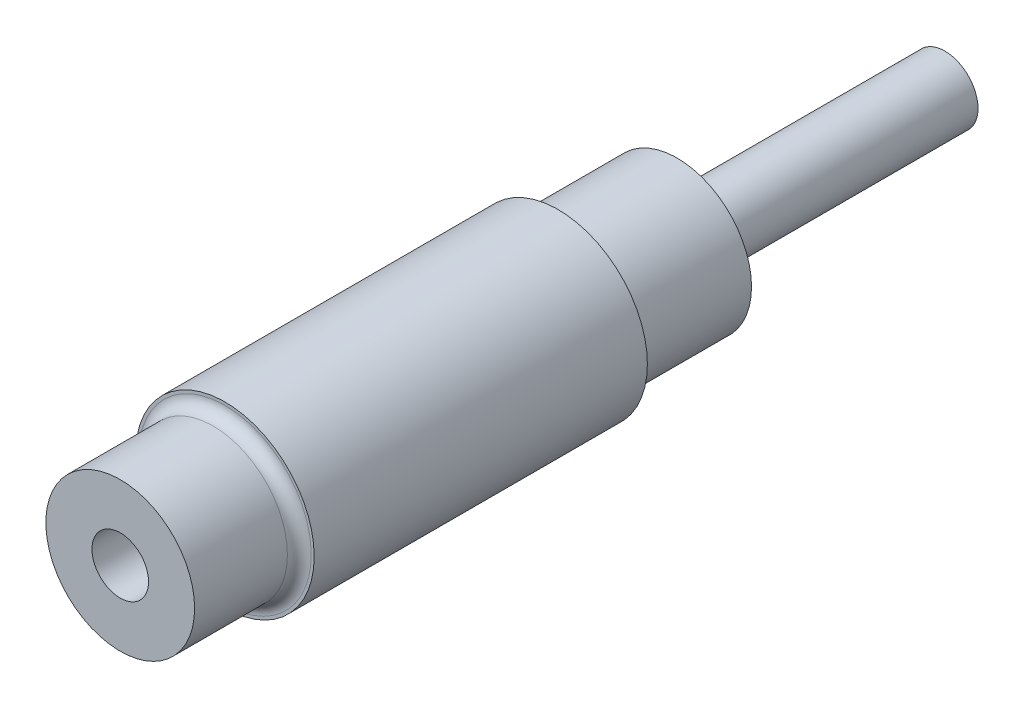
ISO-10303-21;
HEADER;
FILE_DESCRIPTION(('STEP AP214'),'2;1');
FILE_NAME('part.step','',(''),(''),'','','');
FILE_SCHEMA(('AUTOMOTIVE_DESIGN { 1 0 10303 214 1 1 1 1 }'));
ENDSEC;
DATA;
#1=APPLICATION_CONTEXT('core data for automotive mechanical design processes');
#2=APPLICATION_PROTOCOL_DEFINITION('international standard','automotive_design',2000,#1);
#3=PRODUCT_CONTEXT('',#1,'mechanical');
#4=PRODUCT('Part','Part','',(#3));
#5=PRODUCT_RELATED_PRODUCT_CATEGORY('part','',(#4));
#6=PRODUCT_DEFINITION_FORMATION('','',#4);
#7=PRODUCT_DEFINITION_CONTEXT('part definition',#1,'design');
#8=PRODUCT_DEFINITION('design','',#6,#7);
#9=PRODUCT_DEFINITION_SHAPE('','',#8);
#10=(LENGTH_UNIT() NAMED_UNIT(*) SI_UNIT(.MILLI.,.METRE.));
#11=(NAMED_UNIT(*) PLANE_ANGLE_UNIT() SI_UNIT($,.RADIAN.));
#12=(NAMED_UNIT(*) SI_UNIT($,.STERADIAN.) SOLID_ANGLE_UNIT());
#13=UNCERTAINTY_MEASURE_WITH_UNIT(LENGTH_MEASURE(1.E-05),#10,'distance_accuracy_value','');
#14=(GEOMETRIC_REPRESENTATION_CONTEXT(3) GLOBAL_UNCERTAINTY_ASSIGNED_CONTEXT((#13)) GLOBAL_UNIT_ASSIGNED_CONTEXT((#10,
#11,#12)) REPRESENTATION_CONTEXT('',''));
#15=CARTESIAN_POINT('',(0.,0.,0.));
#16=DIRECTION('',(0.,0.,1.));
#17=DIRECTION('',(1.,0.,0.));
#18=AXIS2_PLACEMENT_3D('',#15,#16,#17);
#19=CARTESIAN_POINT('',(0.,0.,93.6));
#20=DIRECTION('',(0.,0.,-1.));
#21=DIRECTION('',(-1.,0.,0.));
#22=AXIS2_PLACEMENT_3D('',#19,#20,#21);
#23=CYLINDRICAL_SURFACE('',#22,12.5);
#24=CARTESIAN_POINT('',(0.,0.,18.5));
#25=DIRECTION('',(0.,0.,1.));
#26=DIRECTION('',(1.,0.,0.));
#27=AXIS2_PLACEMENT_3D('',#24,#25,#26);
#28=CIRCLE('',#27,12.5);
#29=CARTESIAN_POINT('',(12.5,0.,18.5));
#30=VERTEX_POINT('',#29);
#31=EDGE_CURVE('E42',#30,#30,#28,.F.);
#32=ORIENTED_EDGE('',*,*,#31,.T.);
#33=EDGE_LOOP('',(#32));
#34=FACE_BOUND('',#33,.T.);
#35=CARTESIAN_POINT('',(0.,0.,0.));
#36=DIRECTION('',(0.,0.,1.));
#37=DIRECTION('',(1.,0.,0.));
#38=AXIS2_PLACEMENT_3D('',#35,#36,#37);
#39=CIRCLE('',#38,12.5);
#40=CARTESIAN_POINT('',(12.5,0.,0.));
#41=VERTEX_POINT('',#40);
#42=EDGE_CURVE('E58',#41,#41,#39,.T.);
#43=ORIENTED_EDGE('',*,*,#42,.T.);
#44=EDGE_LOOP('',(#43));
#45=FACE_BOUND('',#44,.T.);
#46=ADVANCED_FACE('F31',(#34,#45),#23,.T.);
#47=CARTESIAN_POINT('',(0.,0.,0.));
#48=DIRECTION('',(0.,0.,1.));
#49=DIRECTION('',(1.,0.,0.));
#50=AXIS2_PLACEMENT_3D('',#47,#48,#49);
#51=PLANE('',#50);
#52=CARTESIAN_POINT('',(0.,0.,0.));
#53=DIRECTION('',(0.,0.,1.));
#54=DIRECTION('',(1.,0.,0.));
#55=AXIS2_PLACEMENT_3D('',#52,#53,#54);
#56=CIRCLE('',#55,7.565);
#57=CARTESIAN_POINT('',(7.565,0.,0.));
#58=VERTEX_POINT('',#57);
#59=EDGE_CURVE('E10',#58,#58,#56,.T.);
#60=ORIENTED_EDGE('',*,*,#59,.T.);
#61=EDGE_LOOP('',(#60));
#62=FACE_BOUND('',#61,.T.);
#63=ORIENTED_EDGE('',*,*,#42,.F.);
#64=EDGE_LOOP('',(#63));
#65=FACE_BOUND('',#64,.T.);
#66=ADVANCED_FACE('F107',(#62,#65),#51,.F.);
#67=CARTESIAN_POINT('',(0.,0.,20.));
#68=DIRECTION('',(0.,0.,1.));
#69=DIRECTION('',(1.,0.,0.));
#70=AXIS2_PLACEMENT_3D('',#67,#68,#69);
#71=CYLINDRICAL_SURFACE('',#70,15.);
#72=CARTESIAN_POINT('',(0.,0.,20.));
#73=DIRECTION('',(0.,0.,1.));
#74=DIRECTION('',(1.,0.,0.));
#75=AXIS2_PLACEMENT_3D('',#72,#73,#74);
#76=CIRCLE('',#75,15.);
#77=CARTESIAN_POINT('',(15.,0.,20.));
#78=VERTEX_POINT('',#77);
#79=EDGE_CURVE('E61',#78,#78,#76,.T.);
#80=ORIENTED_EDGE('',*,*,#79,.T.);
#81=EDGE_LOOP('',(#80));
#82=FACE_BOUND('',#81,.T.);
#83=CARTESIAN_POINT('',(0.,0.,76.));
#84=DIRECTION('',(0.,0.,1.));
#85=DIRECTION('',(1.,0.,0.));
#86=AXIS2_PLACEMENT_3D('',#83,#84,#85);
#87=CIRCLE('',#86,15.);
#88=CARTESIAN_POINT('',(15.,0.,76.));
#89=VERTEX_POINT('',#88);
#90=EDGE_CURVE('E64',#89,#89,#87,.T.);
#91=ORIENTED_EDGE('',*,*,#90,.F.);
#92=EDGE_LOOP('',(#91));
#93=FACE_BOUND('',#92,.T.);
#94=ADVANCED_FACE('F112',(#82,#93),#71,.T.);
#95=CARTESIAN_POINT('',(0.,0.,20.));
#96=DIRECTION('',(0.,0.,1.));
#97=DIRECTION('',(1.,0.,0.));
#98=AXIS2_PLACEMENT_3D('',#95,#96,#97);
#99=PLANE('',#98);
#100=CARTESIAN_POINT('',(0.,0.,20.));
#101=DIRECTION('',(0.,0.,1.));
#102=DIRECTION('',(1.,0.,0.));
#103=AXIS2_PLACEMENT_3D('',#100,#101,#102);
#104=CIRCLE('',#103,14.);
#105=CARTESIAN_POINT('',(14.,0.,20.));
#106=VERTEX_POINT('',#105);
#107=EDGE_CURVE('E46',#106,#106,#104,.T.);
#108=ORIENTED_EDGE('',*,*,#107,.T.);
#109=EDGE_LOOP('',(#108));
#110=FACE_BOUND('',#109,.T.);
#111=ORIENTED_EDGE('',*,*,#79,.F.);
#112=EDGE_LOOP('',(#111));
#113=FACE_BOUND('',#112,.T.);
#114=ADVANCED_FACE('F124',(#110,#113),#99,.F.);
#115=CARTESIAN_POINT('',(0.,0.,76.));
#116=DIRECTION('',(0.,0.,1.));
#117=DIRECTION('',(1.,0.,0.));
#118=AXIS2_PLACEMENT_3D('',#115,#116,#117);
#119=PLANE('',#118);
#120=CARTESIAN_POINT('',(0.,0.,76.));
#121=DIRECTION('',(0.,0.,1.));
#122=DIRECTION('',(1.,0.,0.));
#123=AXIS2_PLACEMENT_3D('',#120,#121,#122);
#124=CIRCLE('',#123,14.5);
#125=CARTESIAN_POINT('',(14.5,0.,76.));
#126=VERTEX_POINT('',#125);
#127=EDGE_CURVE('E51',#126,#126,#124,.F.);
#128=ORIENTED_EDGE('',*,*,#127,.T.);
#129=EDGE_LOOP('',(#128));
#130=FACE_BOUND('',#129,.T.);
#131=ORIENTED_EDGE('',*,*,#90,.T.);
#132=EDGE_LOOP('',(#131));
#133=FACE_BOUND('',#132,.T.);
#134=ADVANCED_FACE('F92',(#130,#133),#119,.T.);
#135=CARTESIAN_POINT('',(0.,0.,93.6));
#136=DIRECTION('',(0.,0.,1.));
#137=DIRECTION('',(1.,0.,0.));
#138=AXIS2_PLACEMENT_3D('',#135,#136,#137);
#139=PLANE('',#138);
#140=CARTESIAN_POINT('',(0.,0.,93.6));
#141=DIRECTION('',(0.,0.,1.));
#142=DIRECTION('',(1.,0.,0.));
#143=AXIS2_PLACEMENT_3D('',#140,#141,#142);
#144=CIRCLE('',#143,4.755);
#145=CARTESIAN_POINT('',(4.755,0.,93.6));
#146=VERTEX_POINT('',#145);
#147=EDGE_CURVE('E73',#146,#146,#144,.T.);
#148=ORIENTED_EDGE('',*,*,#147,.F.);
#149=EDGE_LOOP('',(#148));
#150=FACE_BOUND('',#149,.T.);
#151=CARTESIAN_POINT('',(0.,0.,93.6));
#152=DIRECTION('',(0.,0.,1.));
#153=DIRECTION('',(1.,0.,0.));
#154=AXIS2_PLACEMENT_3D('',#151,#152,#153);
#155=CIRCLE('',#154,12.5);
#156=CARTESIAN_POINT('',(12.5,0.,93.6));
#157=VERTEX_POINT('',#156);
#158=EDGE_CURVE('E57',#157,#157,#155,.T.);
#159=ORIENTED_EDGE('',*,*,#158,.T.);
#160=EDGE_LOOP('',(#159));
#161=FACE_BOUND('',#160,.T.);
#162=ADVANCED_FACE('F88',(#150,#161),#139,.T.);
#163=CARTESIAN_POINT('',(0.,0.,78.));
#164=DIRECTION('',(0.,0.,1.));
#165=DIRECTION('',(1.,0.,0.));
#166=AXIS2_PLACEMENT_3D('',#163,#164,#165);
#167=CIRCLE('',#166,12.5);
#168=CARTESIAN_POINT('',(12.5,0.,78.));
#169=VERTEX_POINT('',#168);
#170=EDGE_CURVE('E54',#169,#169,#167,.T.);
#171=ORIENTED_EDGE('',*,*,#170,.T.);
#172=EDGE_LOOP('',(#171));
#173=FACE_BOUND('',#172,.T.);
#174=ORIENTED_EDGE('',*,*,#158,.F.);
#175=EDGE_LOOP('',(#174));
#176=FACE_BOUND('',#175,.T.);
#177=ADVANCED_FACE('F91',(#173,#176),#23,.T.);
#178=CARTESIAN_POINT('',(0.,0.,-45.));
#179=DIRECTION('',(0.,0.,1.));
#180=DIRECTION('',(1.,0.,0.));
#181=AXIS2_PLACEMENT_3D('',#178,#179,#180);
#182=CYLINDRICAL_SURFACE('',#181,5.565);
#183=CARTESIAN_POINT('',(0.,0.,-2.));
#184=DIRECTION('',(0.,0.,1.));
#185=DIRECTION('',(1.,0.,0.));
#186=AXIS2_PLACEMENT_3D('',#183,#184,#185);
#187=CIRCLE('',#186,5.565);
#188=CARTESIAN_POINT('',(5.565,0.,-2.));
#189=VERTEX_POINT('',#188);
#190=EDGE_CURVE('E38',#189,#189,#187,.F.);
#191=ORIENTED_EDGE('',*,*,#190,.T.);
#192=EDGE_LOOP('',(#191));
#193=FACE_BOUND('',#192,.T.);
#194=CARTESIAN_POINT('',(0.,0.,-45.));
#195=DIRECTION('',(0.,0.,-1.));
#196=DIRECTION('',(-1.,0.,0.));
#197=AXIS2_PLACEMENT_3D('',#194,#195,#196);
#198=CIRCLE('',#197,5.565);
#199=CARTESIAN_POINT('',(-5.565,0.,-45.));
#200=VERTEX_POINT('',#199);
#201=EDGE_CURVE('E67',#200,#200,#198,.T.);
#202=ORIENTED_EDGE('',*,*,#201,.F.);
#203=EDGE_LOOP('',(#202));
#204=FACE_BOUND('',#203,.T.);
#205=ADVANCED_FACE('F97',(#193,#204),#182,.T.);
#206=CARTESIAN_POINT('',(0.,0.,-45.));
#207=DIRECTION('',(0.,0.,-1.));
#208=DIRECTION('',(-1.,0.,0.));
#209=AXIS2_PLACEMENT_3D('',#206,#207,#208);
#210=PLANE('',#209);
#211=ORIENTED_EDGE('',*,*,#201,.T.);
#212=EDGE_LOOP('',(#211));
#213=FACE_BOUND('',#212,.T.);
#214=ADVANCED_FACE('F84',(#213),#210,.T.);
#215=CARTESIAN_POINT('',(0.,0.,33.6));
#216=DIRECTION('',(0.,0.,1.));
#217=DIRECTION('',(1.,0.,0.));
#218=AXIS2_PLACEMENT_3D('',#215,#216,#217);
#219=CYLINDRICAL_SURFACE('',#218,4.755);
#220=CARTESIAN_POINT('',(0.,0.,33.6));
#221=DIRECTION('',(0.,0.,1.));
#222=DIRECTION('',(1.,0.,0.));
#223=AXIS2_PLACEMENT_3D('',#220,#221,#222);
#224=CIRCLE('',#223,4.755);
#225=CARTESIAN_POINT('',(4.755,0.,33.6));
#226=VERTEX_POINT('',#225);
#227=EDGE_CURVE('E72',#226,#226,#224,.T.);
#228=ORIENTED_EDGE('',*,*,#227,.F.);
#229=EDGE_LOOP('',(#228));
#230=FACE_BOUND('',#229,.T.);
#231=ORIENTED_EDGE('',*,*,#147,.T.);
#232=EDGE_LOOP('',(#231));
#233=FACE_BOUND('',#232,.T.);
#234=ADVANCED_FACE('F81',(#230,#233),#219,.F.);
#235=CARTESIAN_POINT('',(0.,0.,33.6));
#236=DIRECTION('',(0.,0.,1.));
#237=DIRECTION('',(1.,0.,0.));
#238=AXIS2_PLACEMENT_3D('',#235,#236,#237);
#239=PLANE('',#238);
#240=ORIENTED_EDGE('',*,*,#227,.T.);
#241=EDGE_LOOP('',(#240));
#242=FACE_BOUND('',#241,.T.);
#243=ADVANCED_FACE('F79',(#242),#239,.T.);
#244=CARTESIAN_POINT('',(0.,0.,78.));
#245=DIRECTION('',(0.,0.,1.));
#246=DIRECTION('',(1.,0.,0.));
#247=AXIS2_PLACEMENT_3D('',#244,#245,#246);
#248=TOROIDAL_SURFACE('',#247,14.5,2.);
#249=ORIENTED_EDGE('',*,*,#127,.F.);
#250=EDGE_LOOP('',(#249));
#251=FACE_BOUND('',#250,.T.);
#252=ORIENTED_EDGE('',*,*,#170,.F.);
#253=EDGE_LOOP('',(#252));
#254=FACE_BOUND('',#253,.T.);
#255=ADVANCED_FACE('F121',(#251,#254),#248,.F.);
#256=CARTESIAN_POINT('',(0.,0.,18.5));
#257=DIRECTION('',(0.,0.,1.));
#258=DIRECTION('',(1.,0.,0.));
#259=AXIS2_PLACEMENT_3D('',#256,#257,#258);
#260=TOROIDAL_SURFACE('',#259,14.,1.5);
#261=ORIENTED_EDGE('',*,*,#31,.F.);
#262=EDGE_LOOP('',(#261));
#263=FACE_BOUND('',#262,.T.);
#264=ORIENTED_EDGE('',*,*,#107,.F.);
#265=EDGE_LOOP('',(#264));
#266=FACE_BOUND('',#265,.T.);
#267=ADVANCED_FACE('F118',(#263,#266),#260,.F.);
#268=CARTESIAN_POINT('',(0.,0.,-2.));
#269=DIRECTION('',(0.,0.,1.));
#270=DIRECTION('',(1.,0.,0.));
#271=AXIS2_PLACEMENT_3D('',#268,#269,#270);
#272=TOROIDAL_SURFACE('',#271,7.565,2.);
#273=ORIENTED_EDGE('',*,*,#59,.F.);
#274=EDGE_LOOP('',(#273));
#275=FACE_BOUND('',#274,.T.);
#276=ORIENTED_EDGE('',*,*,#190,.F.);
#277=EDGE_LOOP('',(#276));
#278=FACE_BOUND('',#277,.T.);
#279=ADVANCED_FACE('F33',(#275,#278),#272,.F.);
#280=CLOSED_SHELL('',(#46,#66,#94,#114,#134,#162,#177,#205,#214,#234,#243,#255,#267,#279));
#281=MANIFOLD_SOLID_BREP('B2',#280);
#282=ADVANCED_BREP_SHAPE_REPRESENTATION('',(#18,#281),#14);
#283=SHAPE_DEFINITION_REPRESENTATION(#9,#282);
ENDSEC;
END-ISO-10303-21;
